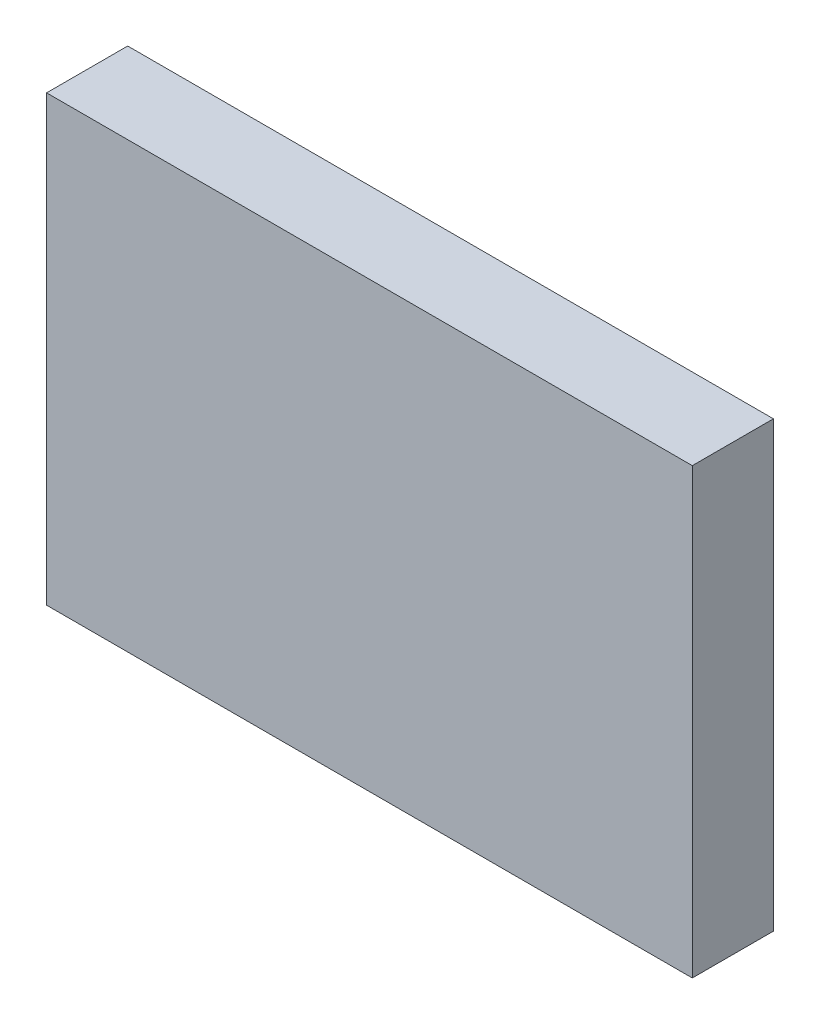
ISO-10303-21;
HEADER;
FILE_DESCRIPTION(('STEP AP214'),'2;1');
FILE_NAME('part.step','',(''),(''),'','','');
FILE_SCHEMA(('AUTOMOTIVE_DESIGN { 1 0 10303 214 1 1 1 1 }'));
ENDSEC;
DATA;
#1=APPLICATION_CONTEXT('core data for automotive mechanical design processes');
#2=APPLICATION_PROTOCOL_DEFINITION('international standard','automotive_design',2000,#1);
#3=PRODUCT_CONTEXT('',#1,'mechanical');
#4=PRODUCT('Part','Part','',(#3));
#5=PRODUCT_RELATED_PRODUCT_CATEGORY('part','',(#4));
#6=PRODUCT_DEFINITION_FORMATION('','',#4);
#7=PRODUCT_DEFINITION_CONTEXT('part definition',#1,'design');
#8=PRODUCT_DEFINITION('design','',#6,#7);
#9=PRODUCT_DEFINITION_SHAPE('','',#8);
#10=(LENGTH_UNIT() NAMED_UNIT(*) SI_UNIT(.MILLI.,.METRE.));
#11=(NAMED_UNIT(*) PLANE_ANGLE_UNIT() SI_UNIT($,.RADIAN.));
#12=(NAMED_UNIT(*) SI_UNIT($,.STERADIAN.) SOLID_ANGLE_UNIT());
#13=UNCERTAINTY_MEASURE_WITH_UNIT(LENGTH_MEASURE(1.E-05),#10,'distance_accuracy_value','');
#14=(GEOMETRIC_REPRESENTATION_CONTEXT(3) GLOBAL_UNCERTAINTY_ASSIGNED_CONTEXT((#13)) GLOBAL_UNIT_ASSIGNED_CONTEXT((#10,
#11,#12)) REPRESENTATION_CONTEXT('',''));
#15=CARTESIAN_POINT('',(0.,0.,0.));
#16=DIRECTION('',(0.,0.,1.));
#17=DIRECTION('',(1.,0.,0.));
#18=AXIS2_PLACEMENT_3D('',#15,#16,#17);
#19=CARTESIAN_POINT('',(1.143,-0.597,0.));
#20=DIRECTION('',(0.,-1.,0.));
#21=DIRECTION('',(0.,0.,-1.));
#22=AXIS2_PLACEMENT_3D('',#19,#20,#21);
#23=PLANE('',#22);
#24=DIRECTION('',(-1.,0.,0.));
#25=VECTOR('',#24,1.);
#26=CARTESIAN_POINT('',(1.549,-0.597,0.));
#27=LINE('',#26,#25);
#28=CARTESIAN_POINT('',(1.549,-0.597,0.));
#29=VERTEX_POINT('',#28);
#30=CARTESIAN_POINT('',(1.143,-0.597,0.));
#31=VERTEX_POINT('',#30);
#32=EDGE_CURVE('E11',#29,#31,#27,.T.);
#33=ORIENTED_EDGE('',*,*,#32,.F.);
#34=DIRECTION('',(0.,0.,-1.));
#35=VECTOR('',#34,1.);
#36=CARTESIAN_POINT('',(1.549,-0.597,0.051));
#37=LINE('',#36,#35);
#38=CARTESIAN_POINT('',(1.549,-0.597,0.051));
#39=VERTEX_POINT('',#38);
#40=EDGE_CURVE('E24',#39,#29,#37,.T.);
#41=ORIENTED_EDGE('',*,*,#40,.F.);
#42=DIRECTION('',(1.,0.,0.));
#43=VECTOR('',#42,1.);
#44=CARTESIAN_POINT('',(1.143,-0.597,0.051));
#45=LINE('',#44,#43);
#46=CARTESIAN_POINT('',(1.143,-0.597,0.051));
#47=VERTEX_POINT('',#46);
#48=EDGE_CURVE('E88',#47,#39,#45,.T.);
#49=ORIENTED_EDGE('',*,*,#48,.F.);
#50=DIRECTION('',(0.,0.,1.));
#51=VECTOR('',#50,1.);
#52=CARTESIAN_POINT('',(1.143,-0.597,0.));
#53=LINE('',#52,#51);
#54=EDGE_CURVE('E77',#31,#47,#53,.T.);
#55=ORIENTED_EDGE('',*,*,#54,.F.);
#56=EDGE_LOOP('',(#33,#41,#49,#55));
#57=FACE_BOUND('',#56,.T.);
#58=ADVANCED_FACE('F17',(#57),#23,.T.);
#59=CARTESIAN_POINT('',(1.549,-0.597,0.));
#60=DIRECTION('',(1.,0.,0.));
#61=DIRECTION('',(0.,1.,0.));
#62=AXIS2_PLACEMENT_3D('',#59,#60,#61);
#63=PLANE('',#62);
#64=DIRECTION('',(0.,-1.,0.));
#65=VECTOR('',#64,1.);
#66=CARTESIAN_POINT('',(1.549,-0.318,0.));
#67=LINE('',#66,#65);
#68=CARTESIAN_POINT('',(1.549,-0.318,0.));
#69=VERTEX_POINT('',#68);
#70=EDGE_CURVE('E85',#69,#29,#67,.T.);
#71=ORIENTED_EDGE('',*,*,#70,.F.);
#72=DIRECTION('',(0.,0.,-1.));
#73=VECTOR('',#72,1.);
#74=CARTESIAN_POINT('',(1.549,-0.318,0.051));
#75=LINE('',#74,#73);
#76=CARTESIAN_POINT('',(1.549,-0.318,0.051));
#77=VERTEX_POINT('',#76);
#78=EDGE_CURVE('E83',#77,#69,#75,.T.);
#79=ORIENTED_EDGE('',*,*,#78,.F.);
#80=DIRECTION('',(0.,1.,0.));
#81=VECTOR('',#80,1.);
#82=CARTESIAN_POINT('',(1.549,-0.597,0.051));
#83=LINE('',#82,#81);
#84=EDGE_CURVE('E72',#39,#77,#83,.T.);
#85=ORIENTED_EDGE('',*,*,#84,.F.);
#86=ORIENTED_EDGE('',*,*,#40,.T.);
#87=EDGE_LOOP('',(#71,#79,#85,#86));
#88=FACE_BOUND('',#87,.T.);
#89=ADVANCED_FACE('F90',(#88),#63,.T.);
#90=CARTESIAN_POINT('',(1.549,-0.318,0.));
#91=DIRECTION('',(0.,1.,0.));
#92=DIRECTION('',(1.,0.,0.));
#93=AXIS2_PLACEMENT_3D('',#90,#91,#92);
#94=PLANE('',#93);
#95=DIRECTION('',(1.,0.,0.));
#96=VECTOR('',#95,1.);
#97=CARTESIAN_POINT('',(1.143,-0.318,0.));
#98=LINE('',#97,#96);
#99=CARTESIAN_POINT('',(1.143,-0.318,0.));
#100=VERTEX_POINT('',#99);
#101=EDGE_CURVE('E60',#100,#69,#98,.T.);
#102=ORIENTED_EDGE('',*,*,#101,.F.);
#103=DIRECTION('',(0.,0.,-1.));
#104=VECTOR('',#103,1.);
#105=CARTESIAN_POINT('',(1.143,-0.318,0.051));
#106=LINE('',#105,#104);
#107=CARTESIAN_POINT('',(1.143,-0.318,0.051));
#108=VERTEX_POINT('',#107);
#109=EDGE_CURVE('E54',#108,#100,#106,.T.);
#110=ORIENTED_EDGE('',*,*,#109,.F.);
#111=DIRECTION('',(-1.,0.,0.));
#112=VECTOR('',#111,1.);
#113=CARTESIAN_POINT('',(1.549,-0.318,0.051));
#114=LINE('',#113,#112);
#115=EDGE_CURVE('E58',#77,#108,#114,.T.);
#116=ORIENTED_EDGE('',*,*,#115,.F.);
#117=ORIENTED_EDGE('',*,*,#78,.T.);
#118=EDGE_LOOP('',(#102,#110,#116,#117));
#119=FACE_BOUND('',#118,.T.);
#120=ADVANCED_FACE('F56',(#119),#94,.T.);
#121=CARTESIAN_POINT('',(1.143,-0.318,0.));
#122=DIRECTION('',(-1.,0.,0.));
#123=DIRECTION('',(0.,0.,1.));
#124=AXIS2_PLACEMENT_3D('',#121,#122,#123);
#125=PLANE('',#124);
#126=DIRECTION('',(0.,1.,0.));
#127=VECTOR('',#126,1.);
#128=CARTESIAN_POINT('',(1.143,-0.597,0.));
#129=LINE('',#128,#127);
#130=EDGE_CURVE('E73',#31,#100,#129,.T.);
#131=ORIENTED_EDGE('',*,*,#130,.F.);
#132=ORIENTED_EDGE('',*,*,#54,.T.);
#133=DIRECTION('',(0.,-1.,0.));
#134=VECTOR('',#133,1.);
#135=CARTESIAN_POINT('',(1.143,-0.318,0.051));
#136=LINE('',#135,#134);
#137=EDGE_CURVE('E70',#108,#47,#136,.T.);
#138=ORIENTED_EDGE('',*,*,#137,.F.);
#139=ORIENTED_EDGE('',*,*,#109,.T.);
#140=EDGE_LOOP('',(#131,#132,#138,#139));
#141=FACE_BOUND('',#140,.T.);
#142=ADVANCED_FACE('F76',(#141),#125,.T.);
#143=CARTESIAN_POINT('',(1.143,-0.318,0.));
#144=DIRECTION('',(0.,0.,-1.));
#145=DIRECTION('',(0.,-1.,0.));
#146=AXIS2_PLACEMENT_3D('',#143,#144,#145);
#147=PLANE('',#146);
#148=ORIENTED_EDGE('',*,*,#101,.T.);
#149=ORIENTED_EDGE('',*,*,#70,.T.);
#150=ORIENTED_EDGE('',*,*,#32,.T.);
#151=ORIENTED_EDGE('',*,*,#130,.T.);
#152=EDGE_LOOP('',(#148,#149,#150,#151));
#153=FACE_BOUND('',#152,.T.);
#154=ADVANCED_FACE('F91',(#153),#147,.T.);
#155=CARTESIAN_POINT('',(1.143,-0.597,0.051));
#156=DIRECTION('',(0.,0.,1.));
#157=DIRECTION('',(1.,0.,0.));
#158=AXIS2_PLACEMENT_3D('',#155,#156,#157);
#159=PLANE('',#158);
#160=ORIENTED_EDGE('',*,*,#48,.T.);
#161=ORIENTED_EDGE('',*,*,#84,.T.);
#162=ORIENTED_EDGE('',*,*,#115,.T.);
#163=ORIENTED_EDGE('',*,*,#137,.T.);
#164=EDGE_LOOP('',(#160,#161,#162,#163));
#165=FACE_BOUND('',#164,.T.);
#166=ADVANCED_FACE('F69',(#165),#159,.T.);
#167=CLOSED_SHELL('',(#58,#89,#120,#142,#154,#166));
#168=MANIFOLD_SOLID_BREP('B1',#167);
#169=ADVANCED_BREP_SHAPE_REPRESENTATION('',(#18,#168),#14);
#170=SHAPE_DEFINITION_REPRESENTATION(#9,#169);
ENDSEC;
END-ISO-10303-21;
